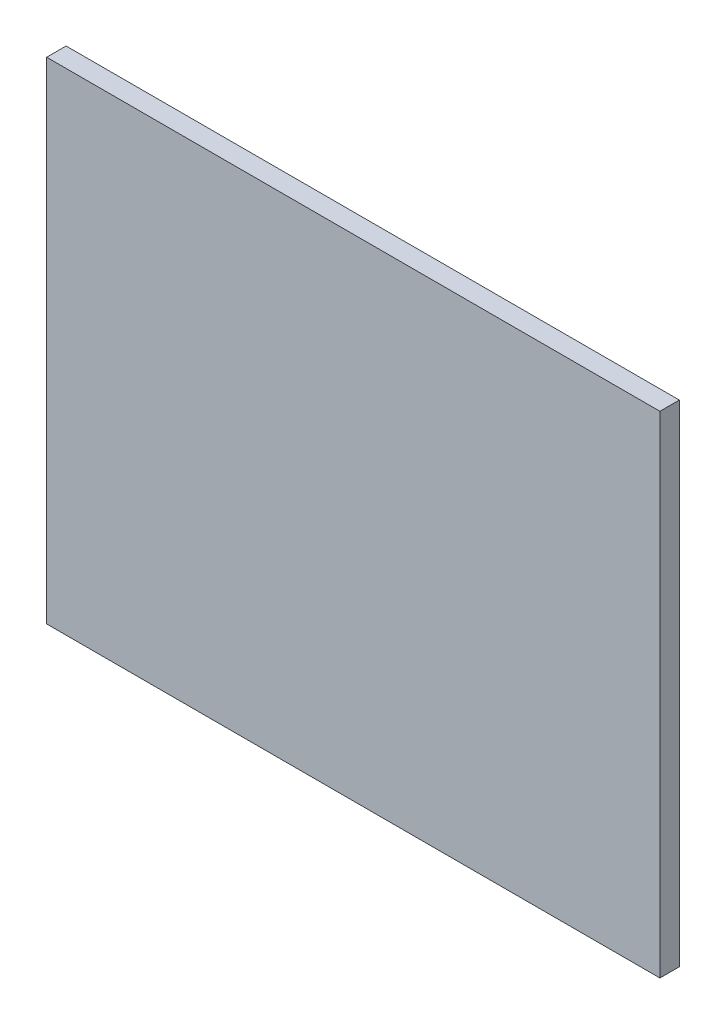
ISO-10303-21;
HEADER;
FILE_DESCRIPTION(('STEP AP214'),'2;1');
FILE_NAME('part.step','',(''),(''),'','','');
FILE_SCHEMA(('AUTOMOTIVE_DESIGN { 1 0 10303 214 1 1 1 1 }'));
ENDSEC;
DATA;
#1=APPLICATION_CONTEXT('core data for automotive mechanical design processes');
#2=APPLICATION_PROTOCOL_DEFINITION('international standard','automotive_design',2000,#1);
#3=PRODUCT_CONTEXT('',#1,'mechanical');
#4=PRODUCT('Part','Part','',(#3));
#5=PRODUCT_RELATED_PRODUCT_CATEGORY('part','',(#4));
#6=PRODUCT_DEFINITION_FORMATION('','',#4);
#7=PRODUCT_DEFINITION_CONTEXT('part definition',#1,'design');
#8=PRODUCT_DEFINITION('design','',#6,#7);
#9=PRODUCT_DEFINITION_SHAPE('','',#8);
#10=(LENGTH_UNIT() NAMED_UNIT(*) SI_UNIT(.MILLI.,.METRE.));
#11=(NAMED_UNIT(*) PLANE_ANGLE_UNIT() SI_UNIT($,.RADIAN.));
#12=(NAMED_UNIT(*) SI_UNIT($,.STERADIAN.) SOLID_ANGLE_UNIT());
#13=UNCERTAINTY_MEASURE_WITH_UNIT(LENGTH_MEASURE(1.E-05),#10,'distance_accuracy_value','');
#14=(GEOMETRIC_REPRESENTATION_CONTEXT(3) GLOBAL_UNCERTAINTY_ASSIGNED_CONTEXT((#13)) GLOBAL_UNIT_ASSIGNED_CONTEXT((#10,
#11,#12)) REPRESENTATION_CONTEXT('',''));
#15=CARTESIAN_POINT('',(0.,0.,0.));
#16=DIRECTION('',(0.,0.,1.));
#17=DIRECTION('',(1.,0.,0.));
#18=AXIS2_PLACEMENT_3D('',#15,#16,#17);
#19=CARTESIAN_POINT('',(50.085,40.085,3.175));
#20=DIRECTION('',(-1.,0.,0.));
#21=DIRECTION('',(0.,-1.,0.));
#22=AXIS2_PLACEMENT_3D('',#19,#20,#21);
#23=PLANE('',#22);
#24=DIRECTION('',(0.,1.,0.));
#25=VECTOR('',#24,1.);
#26=CARTESIAN_POINT('',(50.085,40.085,0.));
#27=LINE('',#26,#25);
#28=CARTESIAN_POINT('',(50.085,-40.085,0.));
#29=VERTEX_POINT('',#28);
#30=CARTESIAN_POINT('',(50.085,40.085,0.));
#31=VERTEX_POINT('',#30);
#32=EDGE_CURVE('E99',#29,#31,#27,.T.);
#33=ORIENTED_EDGE('',*,*,#32,.T.);
#34=DIRECTION('',(0.,0.,-1.));
#35=VECTOR('',#34,1.);
#36=CARTESIAN_POINT('',(50.085,40.085,3.175));
#37=LINE('',#36,#35);
#38=CARTESIAN_POINT('',(50.085,40.085,3.175));
#39=VERTEX_POINT('',#38);
#40=EDGE_CURVE('E11',#39,#31,#37,.T.);
#41=ORIENTED_EDGE('',*,*,#40,.F.);
#42=DIRECTION('',(0.,1.,0.));
#43=VECTOR('',#42,1.);
#44=CARTESIAN_POINT('',(50.085,40.085,3.175));
#45=LINE('',#44,#43);
#46=CARTESIAN_POINT('',(50.085,-40.085,3.175));
#47=VERTEX_POINT('',#46);
#48=EDGE_CURVE('E87',#47,#39,#45,.T.);
#49=ORIENTED_EDGE('',*,*,#48,.F.);
#50=DIRECTION('',(0.,0.,-1.));
#51=VECTOR('',#50,1.);
#52=CARTESIAN_POINT('',(50.085,-40.085,3.175));
#53=LINE('',#52,#51);
#54=EDGE_CURVE('E95',#47,#29,#53,.T.);
#55=ORIENTED_EDGE('',*,*,#54,.T.);
#56=EDGE_LOOP('',(#33,#41,#49,#55));
#57=FACE_BOUND('',#56,.T.);
#58=ADVANCED_FACE('F36',(#57),#23,.F.);
#59=CARTESIAN_POINT('',(-50.085,40.085,3.175));
#60=DIRECTION('',(0.,-1.,0.));
#61=DIRECTION('',(0.,0.,-1.));
#62=AXIS2_PLACEMENT_3D('',#59,#60,#61);
#63=PLANE('',#62);
#64=DIRECTION('',(-1.,0.,0.));
#65=VECTOR('',#64,1.);
#66=CARTESIAN_POINT('',(-50.085,40.085,0.));
#67=LINE('',#66,#65);
#68=CARTESIAN_POINT('',(-50.085,40.085,0.));
#69=VERTEX_POINT('',#68);
#70=EDGE_CURVE('E91',#31,#69,#67,.T.);
#71=ORIENTED_EDGE('',*,*,#70,.T.);
#72=DIRECTION('',(0.,0.,-1.));
#73=VECTOR('',#72,1.);
#74=CARTESIAN_POINT('',(-50.085,40.085,3.175));
#75=LINE('',#74,#73);
#76=CARTESIAN_POINT('',(-50.085,40.085,3.175));
#77=VERTEX_POINT('',#76);
#78=EDGE_CURVE('E44',#77,#69,#75,.T.);
#79=ORIENTED_EDGE('',*,*,#78,.F.);
#80=DIRECTION('',(-1.,0.,0.));
#81=VECTOR('',#80,1.);
#82=CARTESIAN_POINT('',(-50.085,40.085,3.175));
#83=LINE('',#82,#81);
#84=EDGE_CURVE('E82',#39,#77,#83,.T.);
#85=ORIENTED_EDGE('',*,*,#84,.F.);
#86=ORIENTED_EDGE('',*,*,#40,.T.);
#87=EDGE_LOOP('',(#71,#79,#85,#86));
#88=FACE_BOUND('',#87,.T.);
#89=ADVANCED_FACE('F90',(#88),#63,.F.);
#90=CARTESIAN_POINT('',(-50.085,40.085,3.175));
#91=DIRECTION('',(1.,0.,0.));
#92=DIRECTION('',(0.,1.,0.));
#93=AXIS2_PLACEMENT_3D('',#90,#91,#92);
#94=PLANE('',#93);
#95=DIRECTION('',(0.,-1.,0.));
#96=VECTOR('',#95,1.);
#97=CARTESIAN_POINT('',(-50.085,40.085,0.));
#98=LINE('',#97,#96);
#99=CARTESIAN_POINT('',(-50.085,-40.085,0.));
#100=VERTEX_POINT('',#99);
#101=EDGE_CURVE('E69',#69,#100,#98,.T.);
#102=ORIENTED_EDGE('',*,*,#101,.T.);
#103=DIRECTION('',(0.,0.,-1.));
#104=VECTOR('',#103,1.);
#105=CARTESIAN_POINT('',(-50.085,-40.085,3.175));
#106=LINE('',#105,#104);
#107=CARTESIAN_POINT('',(-50.085,-40.085,3.175));
#108=VERTEX_POINT('',#107);
#109=EDGE_CURVE('E92',#108,#100,#106,.T.);
#110=ORIENTED_EDGE('',*,*,#109,.F.);
#111=DIRECTION('',(0.,-1.,0.));
#112=VECTOR('',#111,1.);
#113=CARTESIAN_POINT('',(-50.085,40.085,3.175));
#114=LINE('',#113,#112);
#115=EDGE_CURVE('E85',#77,#108,#114,.T.);
#116=ORIENTED_EDGE('',*,*,#115,.F.);
#117=ORIENTED_EDGE('',*,*,#78,.T.);
#118=EDGE_LOOP('',(#102,#110,#116,#117));
#119=FACE_BOUND('',#118,.T.);
#120=ADVANCED_FACE('F93',(#119),#94,.F.);
#121=CARTESIAN_POINT('',(-50.085,-40.085,3.175));
#122=DIRECTION('',(0.,1.,0.));
#123=DIRECTION('',(0.,0.,1.));
#124=AXIS2_PLACEMENT_3D('',#121,#122,#123);
#125=PLANE('',#124);
#126=DIRECTION('',(1.,0.,0.));
#127=VECTOR('',#126,1.);
#128=CARTESIAN_POINT('',(-50.085,-40.085,0.));
#129=LINE('',#128,#127);
#130=EDGE_CURVE('E75',#100,#29,#129,.T.);
#131=ORIENTED_EDGE('',*,*,#130,.T.);
#132=ORIENTED_EDGE('',*,*,#54,.F.);
#133=DIRECTION('',(1.,0.,0.));
#134=VECTOR('',#133,1.);
#135=CARTESIAN_POINT('',(-50.085,-40.085,3.175));
#136=LINE('',#135,#134);
#137=EDGE_CURVE('E52',#108,#47,#136,.T.);
#138=ORIENTED_EDGE('',*,*,#137,.F.);
#139=ORIENTED_EDGE('',*,*,#109,.T.);
#140=EDGE_LOOP('',(#131,#132,#138,#139));
#141=FACE_BOUND('',#140,.T.);
#142=ADVANCED_FACE('F106',(#141),#125,.F.);
#143=CARTESIAN_POINT('',(0.,0.,3.175));
#144=DIRECTION('',(0.,0.,1.));
#145=DIRECTION('',(1.,0.,0.));
#146=AXIS2_PLACEMENT_3D('',#143,#144,#145);
#147=PLANE('',#146);
#148=ORIENTED_EDGE('',*,*,#48,.T.);
#149=ORIENTED_EDGE('',*,*,#84,.T.);
#150=ORIENTED_EDGE('',*,*,#115,.T.);
#151=ORIENTED_EDGE('',*,*,#137,.T.);
#152=EDGE_LOOP('',(#148,#149,#150,#151));
#153=FACE_BOUND('',#152,.T.);
#154=ADVANCED_FACE('F83',(#153),#147,.T.);
#155=CARTESIAN_POINT('',(0.,0.,0.));
#156=DIRECTION('',(0.,0.,1.));
#157=DIRECTION('',(1.,0.,0.));
#158=AXIS2_PLACEMENT_3D('',#155,#156,#157);
#159=PLANE('',#158);
#160=ORIENTED_EDGE('',*,*,#32,.F.);
#161=ORIENTED_EDGE('',*,*,#130,.F.);
#162=ORIENTED_EDGE('',*,*,#101,.F.);
#163=ORIENTED_EDGE('',*,*,#70,.F.);
#164=EDGE_LOOP('',(#160,#161,#162,#163));
#165=FACE_BOUND('',#164,.T.);
#166=ADVANCED_FACE('F109',(#165),#159,.F.);
#167=CLOSED_SHELL('',(#58,#89,#120,#142,#154,#166));
#168=MANIFOLD_SOLID_BREP('B2',#167);
#169=ADVANCED_BREP_SHAPE_REPRESENTATION('',(#18,#168),#14);
#170=SHAPE_DEFINITION_REPRESENTATION(#9,#169);
ENDSEC;
END-ISO-10303-21;
